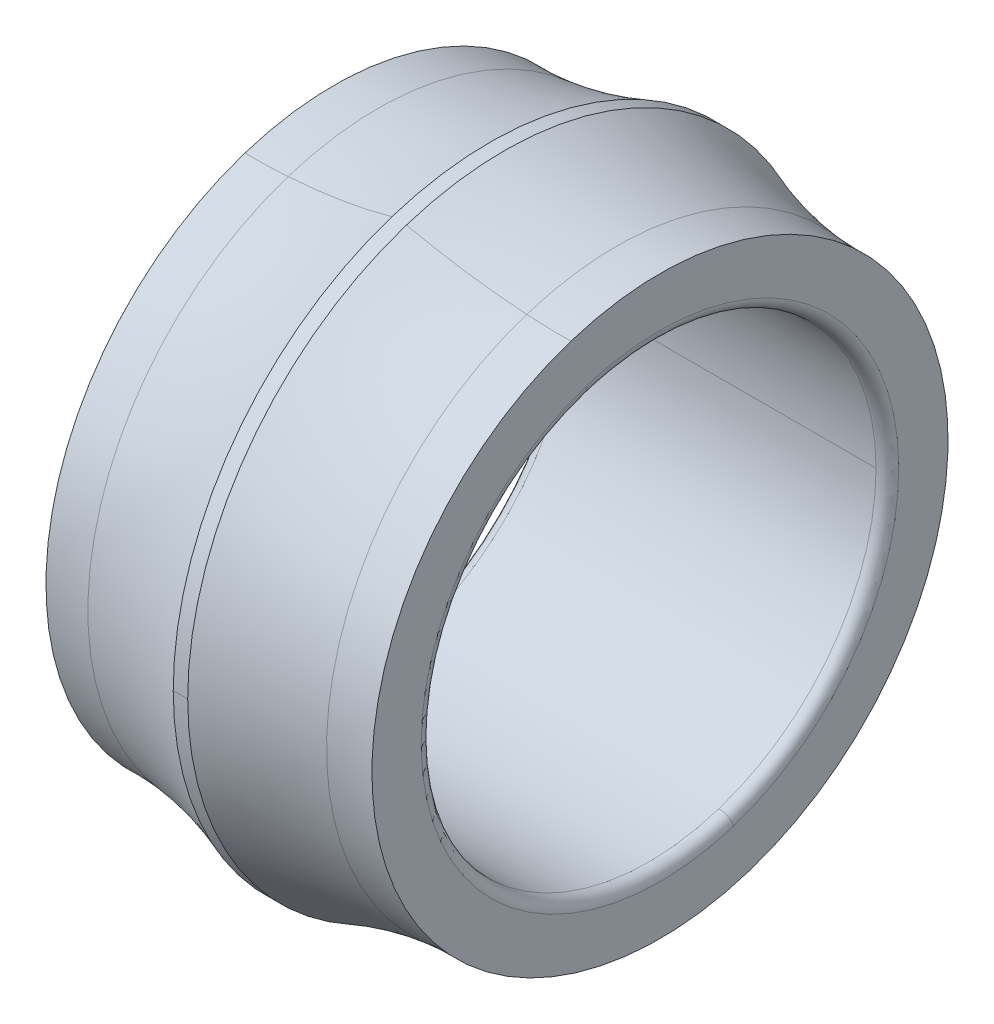
ISO-10303-21;
HEADER;
FILE_DESCRIPTION(('STEP AP214'),'2;1');
FILE_NAME('part.step','',(''),(''),'','','');
FILE_SCHEMA(('AUTOMOTIVE_DESIGN { 1 0 10303 214 1 1 1 1 }'));
ENDSEC;
DATA;
#1=APPLICATION_CONTEXT('core data for automotive mechanical design processes');
#2=APPLICATION_PROTOCOL_DEFINITION('international standard','automotive_design',2000,#1);
#3=PRODUCT_CONTEXT('',#1,'mechanical');
#4=PRODUCT('Part','Part','',(#3));
#5=PRODUCT_RELATED_PRODUCT_CATEGORY('part','',(#4));
#6=PRODUCT_DEFINITION_FORMATION('','',#4);
#7=PRODUCT_DEFINITION_CONTEXT('part definition',#1,'design');
#8=PRODUCT_DEFINITION('design','',#6,#7);
#9=PRODUCT_DEFINITION_SHAPE('','',#8);
#10=(LENGTH_UNIT() NAMED_UNIT(*) SI_UNIT(.MILLI.,.METRE.));
#11=(NAMED_UNIT(*) PLANE_ANGLE_UNIT() SI_UNIT($,.RADIAN.));
#12=(NAMED_UNIT(*) SI_UNIT($,.STERADIAN.) SOLID_ANGLE_UNIT());
#13=UNCERTAINTY_MEASURE_WITH_UNIT(LENGTH_MEASURE(1.E-05),#10,'distance_accuracy_value','');
#14=(GEOMETRIC_REPRESENTATION_CONTEXT(3) GLOBAL_UNCERTAINTY_ASSIGNED_CONTEXT((#13)) GLOBAL_UNIT_ASSIGNED_CONTEXT((#10,
#11,#12)) REPRESENTATION_CONTEXT('',''));
#15=CARTESIAN_POINT('',(0.,0.,0.));
#16=DIRECTION('',(0.,0.,1.));
#17=DIRECTION('',(1.,0.,0.));
#18=AXIS2_PLACEMENT_3D('',#15,#16,#17);
#19=CARTESIAN_POINT('',(0.,76.,0.));
#20=DIRECTION('',(-1.,0.,0.));
#21=DIRECTION('',(0.,0.,1.));
#22=AXIS2_PLACEMENT_3D('',#19,#20,#21);
#23=PLANE('',#22);
#24=CARTESIAN_POINT('',(0.,0.,0.));
#25=DIRECTION('',(1.,0.,0.));
#26=DIRECTION('',(0.,0.,-1.));
#27=AXIS2_PLACEMENT_3D('',#24,#25,#26);
#28=CIRCLE('',#27,63.);
#29=CARTESIAN_POINT('',(0.,59.9165605265947,19.4680706456217));
#30=VERTEX_POINT('',#29);
#31=CARTESIAN_POINT('',(0.,-59.9165605265947,-19.4680706456217));
#32=VERTEX_POINT('',#31);
#33=EDGE_CURVE('E11',#30,#32,#28,.T.);
#34=ORIENTED_EDGE('',*,*,#33,.T.);
#35=CARTESIAN_POINT('',(0.,-59.9165605265947,-19.4680706456217));
#36=CARTESIAN_POINT('',(0.,-56.8583989349152,-28.8796539022212));
#37=CARTESIAN_POINT('',(0.,-51.953038420579,-37.6913393008345));
#38=CARTESIAN_POINT('',(0.,-45.3543236026861,-45.4170253090255));
#39=CARTESIAN_POINT('',(0.,-29.48336715629,-57.8643440421352));
#40=CARTESIAN_POINT('',(0.,-10.0845480190999,-63.3879307021728));
#41=CARTESIAN_POINT('',(0.,0.0443392231772033,-64.1851086887682));
#42=CARTESIAN_POINT('',(0.,20.0683771201649,-61.7641138805563));
#43=CARTESIAN_POINT('',(0.,37.6911891189796,-51.9529056564982));
#44=CARTESIAN_POINT('',(0.,45.4170615681163,-45.3543645746572));
#45=CARTESIAN_POINT('',(0.,57.8643531423797,-29.4833492960546));
#46=CARTESIAN_POINT('',(0.,63.3878762425928,-10.0845427675995));
#47=CARTESIAN_POINT('',(0.,64.1853043718456,0.0442957602732115));
#48=CARTESIAN_POINT('',(0.,62.9744456663331,10.0563975643414));
#49=CARTESIAN_POINT('',(0.,59.9165605265947,19.4680706456217));
#50=B_SPLINE_CURVE_WITH_KNOTS('',5,(#35,#36,#37,#38,#39,#40,#41,#42,#43,#44,#45,#46,#47,#48,
#49),.UNSPECIFIED.,.F.,.F.,(6,3,3,3,6),(0.,0.785398163397448,1.5707963267949,2.35619449019234,
3.14159265358979),.UNSPECIFIED.);
#51=EDGE_CURVE('E26',#32,#30,#50,.T.);
#52=ORIENTED_EDGE('',*,*,#51,.T.);
#53=EDGE_LOOP('',(#34,#52));
#54=FACE_BOUND('',#53,.T.);
#55=CARTESIAN_POINT('',(-1.38777878078145E-13,0.,0.));
#56=DIRECTION('',(1.,0.,0.));
#57=DIRECTION('',(0.,0.,-1.));
#58=AXIS2_PLACEMENT_3D('',#55,#56,#57);
#59=CIRCLE('',#58,76.);
#60=CARTESIAN_POINT('',(0.,72.2802952384316,23.485291572496));
#61=VERTEX_POINT('',#60);
#62=CARTESIAN_POINT('',(0.,-72.2802952384316,-23.485291572496));
#63=VERTEX_POINT('',#62);
#64=EDGE_CURVE('E368',#61,#63,#59,.T.);
#65=ORIENTED_EDGE('',*,*,#64,.F.);
#66=CARTESIAN_POINT('',(-1.38777878078145E-13,0.,0.));
#67=DIRECTION('',(1.,0.,0.));
#68=DIRECTION('',(0.,-0.951056516295154,-0.309016994374947));
#69=AXIS2_PLACEMENT_3D('',#66,#67,#68);
#70=CIRCLE('',#69,76.);
#71=EDGE_CURVE('E363',#63,#61,#70,.T.);
#72=ORIENTED_EDGE('',*,*,#71,.F.);
#73=EDGE_LOOP('',(#65,#72));
#74=FACE_BOUND('',#73,.T.);
#75=ADVANCED_FACE('F17',(#54,#74),#23,.T.);
#76=CARTESIAN_POINT('',(2.37194878616791,0.,0.));
#77=DIRECTION('',(1.,0.,0.));
#78=DIRECTION('',(0.,-0.309016994374947,0.951056516295154));
#79=AXIS2_PLACEMENT_3D('',#76,#77,#78);
#80=TOROIDAL_SURFACE('',#79,161.967283654771,86.0000000001395);
#81=CARTESIAN_POINT('',(2.37194878616791,-154.040040546495,-50.0506431820717));
#82=DIRECTION('',(0.,0.309016994374947,-0.951056516295154));
#83=DIRECTION('',(-0.0275807998391167,0.950694712882917,0.308899437320147));
#84=AXIS2_PLACEMENT_3D('',#81,#82,#83);
#85=CIRCLE('',#84,86.0000000001395);
#86=CARTESIAN_POINT('',(11.5183087513062,-72.7130624133017,-23.6259061514943));
#87=VERTEX_POINT('',#86);
#88=EDGE_CURVE('E358',#63,#87,#85,.T.);
#89=ORIENTED_EDGE('',*,*,#88,.F.);
#90=ORIENTED_EDGE('',*,*,#71,.T.);
#91=CARTESIAN_POINT('',(2.37194878616791,154.040040546495,50.0506431820717));
#92=DIRECTION('',(0.,-0.309016994374947,0.951056516295154));
#93=DIRECTION('',(-0.0275807998391176,-0.950694712882916,-0.308899437320147));
#94=AXIS2_PLACEMENT_3D('',#91,#92,#93);
#95=CIRCLE('',#94,86.0000000001395);
#96=CARTESIAN_POINT('',(11.5183087513061,72.7130624133017,23.6259061514943));
#97=VERTEX_POINT('',#96);
#98=EDGE_CURVE('E354',#61,#97,#95,.T.);
#99=ORIENTED_EDGE('',*,*,#98,.T.);
#100=CARTESIAN_POINT('',(11.518308751306,0.,0.));
#101=DIRECTION('',(1.,0.,0.));
#102=DIRECTION('',(0.,-0.951056516295154,-0.309016994374947));
#103=AXIS2_PLACEMENT_3D('',#100,#101,#102);
#104=CIRCLE('',#103,76.455038336266);
#105=EDGE_CURVE('E349',#87,#97,#104,.T.);
#106=ORIENTED_EDGE('',*,*,#105,.F.);
#107=EDGE_LOOP('',(#89,#90,#99,#106));
#108=FACE_BOUND('',#107,.T.);
#109=ADVANCED_FACE('F389',(#108),#80,.F.);
#110=CARTESIAN_POINT('',(0.196432480434876,0.,0.));
#111=DIRECTION('',(1.,0.,0.));
#112=DIRECTION('',(0.,-0.309016994374947,0.951056516295154));
#113=AXIS2_PLACEMENT_3D('',#110,#111,#112);
#114=TOROIDAL_SURFACE('',#113,189.428633383765,113.539499999996);
#115=CARTESIAN_POINT('',(0.196432480434876,-180.157336152515,-58.5366669368048));
#116=DIRECTION('',(0.,0.309016994374947,-0.951056516295154));
#117=DIRECTION('',(0.0997175103895268,0.946316248875652,0.30747678812494));
#118=AXIS2_PLACEMENT_3D('',#115,#116,#117);
#119=CIRCLE('',#118,113.539499999996);
#120=CARTESIAN_POINT('',(41.0917087807872,-79.4225611437111,-25.805954440854));
#121=VERTEX_POINT('',#120);
#122=EDGE_CURVE('E344',#87,#121,#119,.T.);
#123=ORIENTED_EDGE('',*,*,#122,.F.);
#124=ORIENTED_EDGE('',*,*,#105,.T.);
#125=CARTESIAN_POINT('',(0.196432480434876,180.157336152515,58.5366669368049));
#126=DIRECTION('',(0.,-0.309016994374947,0.951056516295154));
#127=DIRECTION('',(0.0997175103895259,-0.946316248875652,-0.30747678812494));
#128=AXIS2_PLACEMENT_3D('',#125,#126,#127);
#129=CIRCLE('',#128,113.539499999996);
#130=CARTESIAN_POINT('',(41.0917087807871,79.422561143711,25.805954440854));
#131=VERTEX_POINT('',#130);
#132=EDGE_CURVE('E340',#97,#131,#129,.T.);
#133=ORIENTED_EDGE('',*,*,#132,.T.);
#134=CARTESIAN_POINT('',(41.091708780787,0.,0.));
#135=DIRECTION('',(1.,0.,0.));
#136=DIRECTION('',(0.,0.,-1.));
#137=AXIS2_PLACEMENT_3D('',#134,#135,#136);
#138=CIRCLE('',#137,83.509822794866);
#139=CARTESIAN_POINT('',(41.091708780787,0.,-83.509822794866));
#140=VERTEX_POINT('',#139);
#141=EDGE_CURVE('E335',#140,#131,#138,.T.);
#142=ORIENTED_EDGE('',*,*,#141,.F.);
#143=CARTESIAN_POINT('',(41.091708780787,0.,0.));
#144=DIRECTION('',(1.,0.,0.));
#145=DIRECTION('',(0.,0.,-1.));
#146=AXIS2_PLACEMENT_3D('',#143,#144,#145);
#147=CIRCLE('',#146,83.509822794866);
#148=EDGE_CURVE('E330',#121,#140,#147,.T.);
#149=ORIENTED_EDGE('',*,*,#148,.F.);
#150=EDGE_LOOP('',(#123,#124,#133,#142,#149));
#151=FACE_BOUND('',#150,.T.);
#152=ADVANCED_FACE('F392',(#151),#114,.F.);
#153=CARTESIAN_POINT('',(86.,0.,0.));
#154=DIRECTION('',(1.,0.,0.));
#155=DIRECTION('',(0.,1.,0.));
#156=AXIS2_PLACEMENT_3D('',#153,#154,#155);
#157=CYLINDRICAL_SURFACE('',#156,83.509822794866);
#158=DIRECTION('',(1.,0.,0.));
#159=VECTOR('',#158,1.);
#160=CARTESIAN_POINT('',(41.091708780787,0.,83.509822794866));
#161=LINE('',#160,#159);
#162=CARTESIAN_POINT('',(41.091708780787,0.,83.509822794866));
#163=VERTEX_POINT('',#162);
#164=CARTESIAN_POINT('',(44.908291219213,0.,83.509822794866));
#165=VERTEX_POINT('',#164);
#166=EDGE_CURVE('E325',#163,#165,#161,.T.);
#167=ORIENTED_EDGE('',*,*,#166,.F.);
#168=CARTESIAN_POINT('',(41.091708780787,0.,0.));
#169=DIRECTION('',(1.,0.,0.));
#170=DIRECTION('',(0.,0.,-1.));
#171=AXIS2_PLACEMENT_3D('',#168,#169,#170);
#172=CIRCLE('',#171,83.509822794866);
#173=EDGE_CURVE('E320',#163,#121,#172,.T.);
#174=ORIENTED_EDGE('',*,*,#173,.T.);
#175=ORIENTED_EDGE('',*,*,#148,.T.);
#176=DIRECTION('',(1.,0.,0.));
#177=VECTOR('',#176,1.);
#178=CARTESIAN_POINT('',(41.091708780787,0.,-83.509822794866));
#179=LINE('',#178,#177);
#180=CARTESIAN_POINT('',(44.908291219213,0.,-83.509822794866));
#181=VERTEX_POINT('',#180);
#182=EDGE_CURVE('E316',#140,#181,#179,.T.);
#183=ORIENTED_EDGE('',*,*,#182,.T.);
#184=CARTESIAN_POINT('',(44.908291219213,0.,0.));
#185=DIRECTION('',(1.,0.,0.));
#186=DIRECTION('',(0.,0.,-1.));
#187=AXIS2_PLACEMENT_3D('',#184,#185,#186);
#188=CIRCLE('',#187,83.509822794866);
#189=CARTESIAN_POINT('',(44.9082912192132,-79.4225611437111,-25.8059544408531));
#190=VERTEX_POINT('',#189);
#191=EDGE_CURVE('E311',#190,#181,#188,.T.);
#192=ORIENTED_EDGE('',*,*,#191,.F.);
#193=CARTESIAN_POINT('',(44.908291219213,0.,0.));
#194=DIRECTION('',(1.,0.,0.));
#195=DIRECTION('',(0.,0.,-1.));
#196=AXIS2_PLACEMENT_3D('',#193,#194,#195);
#197=CIRCLE('',#196,83.509822794866);
#198=EDGE_CURVE('E306',#165,#190,#197,.T.);
#199=ORIENTED_EDGE('',*,*,#198,.F.);
#200=EDGE_LOOP('',(#167,#174,#175,#183,#192,#199));
#201=FACE_BOUND('',#200,.T.);
#202=ADVANCED_FACE('F403',(#201),#157,.T.);
#203=CARTESIAN_POINT('',(85.8035675195625,0.,0.));
#204=DIRECTION('',(1.,0.,0.));
#205=DIRECTION('',(0.,0.309016994374937,-0.951056516295157));
#206=AXIS2_PLACEMENT_3D('',#203,#204,#205);
#207=TOROIDAL_SURFACE('',#206,189.42863338375,113.539499999982);
#208=CARTESIAN_POINT('',(85.8035675195625,-180.157336152502,-58.5366669367984));
#209=DIRECTION('',(0.,0.309016994374937,-0.951056516295157));
#210=DIRECTION('',(-0.360185453523715,0.887222288356097,0.288275996423716));
#211=AXIS2_PLACEMENT_3D('',#208,#209,#210);
#212=CIRCLE('',#211,113.539499999982);
#213=CARTESIAN_POINT('',(74.4816912487021,-72.7130624133006,-23.625906151494));
#214=VERTEX_POINT('',#213);
#215=EDGE_CURVE('E302',#190,#214,#212,.T.);
#216=ORIENTED_EDGE('',*,*,#215,.T.);
#217=CARTESIAN_POINT('',(74.481691248702,0.,0.));
#218=DIRECTION('',(1.,0.,0.));
#219=DIRECTION('',(0.,0.,-1.));
#220=AXIS2_PLACEMENT_3D('',#217,#218,#219);
#221=CIRCLE('',#220,76.455038336265);
#222=CARTESIAN_POINT('',(74.4816912487021,72.7130624133006,23.625906151494));
#223=VERTEX_POINT('',#222);
#224=EDGE_CURVE('E297',#223,#214,#221,.T.);
#225=ORIENTED_EDGE('',*,*,#224,.F.);
#226=CARTESIAN_POINT('',(85.8035675195625,180.157336152502,58.5366669368004));
#227=DIRECTION('',(0.,-0.309016994374947,0.951056516295154));
#228=DIRECTION('',(-0.360185453523715,-0.887222288356094,-0.288275996423726));
#229=AXIS2_PLACEMENT_3D('',#226,#227,#228);
#230=CIRCLE('',#229,113.539499999982);
#231=CARTESIAN_POINT('',(44.9082912192131,79.4225611437108,25.8059544408539));
#232=VERTEX_POINT('',#231);
#233=EDGE_CURVE('E292',#232,#223,#230,.T.);
#234=ORIENTED_EDGE('',*,*,#233,.F.);
#235=CARTESIAN_POINT('',(44.908291219213,0.,0.));
#236=DIRECTION('',(1.,0.,0.));
#237=DIRECTION('',(0.,0.,-1.));
#238=AXIS2_PLACEMENT_3D('',#235,#236,#237);
#239=CIRCLE('',#238,83.509822794866);
#240=EDGE_CURVE('E287',#232,#165,#239,.T.);
#241=ORIENTED_EDGE('',*,*,#240,.T.);
#242=ORIENTED_EDGE('',*,*,#198,.T.);
#243=EDGE_LOOP('',(#216,#225,#234,#241,#242));
#244=FACE_BOUND('',#243,.T.);
#245=ADVANCED_FACE('F406',(#244),#207,.F.);
#246=CARTESIAN_POINT('',(86.,0.,0.));
#247=DIRECTION('',(1.,0.,0.));
#248=DIRECTION('',(0.,-1.,0.));
#249=AXIS2_PLACEMENT_3D('',#246,#247,#248);
#250=CYLINDRICAL_SURFACE('',#249,83.509822794866);
#251=ORIENTED_EDGE('',*,*,#166,.T.);
#252=ORIENTED_EDGE('',*,*,#240,.F.);
#253=CARTESIAN_POINT('',(44.908291219213,0.,0.));
#254=DIRECTION('',(1.,0.,0.));
#255=DIRECTION('',(0.,0.,-1.));
#256=AXIS2_PLACEMENT_3D('',#253,#254,#255);
#257=CIRCLE('',#256,83.509822794866);
#258=EDGE_CURVE('E282',#181,#232,#257,.T.);
#259=ORIENTED_EDGE('',*,*,#258,.F.);
#260=ORIENTED_EDGE('',*,*,#182,.F.);
#261=ORIENTED_EDGE('',*,*,#141,.T.);
#262=CARTESIAN_POINT('',(41.091708780787,0.,0.));
#263=DIRECTION('',(1.,0.,0.));
#264=DIRECTION('',(0.,0.,-1.));
#265=AXIS2_PLACEMENT_3D('',#262,#263,#264);
#266=CIRCLE('',#265,83.509822794866);
#267=EDGE_CURVE('E277',#131,#163,#266,.T.);
#268=ORIENTED_EDGE('',*,*,#267,.T.);
#269=EDGE_LOOP('',(#251,#252,#259,#260,#261,#268));
#270=FACE_BOUND('',#269,.T.);
#271=ADVANCED_FACE('F400',(#270),#250,.T.);
#272=CARTESIAN_POINT('',(0.196432480434876,0.,0.));
#273=DIRECTION('',(1.,0.,0.));
#274=DIRECTION('',(0.,0.309016994374947,-0.951056516295154));
#275=AXIS2_PLACEMENT_3D('',#272,#273,#274);
#276=TOROIDAL_SURFACE('',#275,189.428633383765,113.539499999996);
#277=ORIENTED_EDGE('',*,*,#122,.T.);
#278=ORIENTED_EDGE('',*,*,#173,.F.);
#279=ORIENTED_EDGE('',*,*,#267,.F.);
#280=ORIENTED_EDGE('',*,*,#132,.F.);
#281=CARTESIAN_POINT('',(11.518308751306,0.,0.));
#282=DIRECTION('',(1.,0.,0.));
#283=DIRECTION('',(0.,0.,-1.));
#284=AXIS2_PLACEMENT_3D('',#281,#282,#283);
#285=CIRCLE('',#284,76.455038336266);
#286=EDGE_CURVE('E272',#97,#87,#285,.T.);
#287=ORIENTED_EDGE('',*,*,#286,.T.);
#288=EDGE_LOOP('',(#277,#278,#279,#280,#287));
#289=FACE_BOUND('',#288,.T.);
#290=ADVANCED_FACE('F397',(#289),#276,.F.);
#291=CARTESIAN_POINT('',(2.37194878616791,0.,0.));
#292=DIRECTION('',(1.,0.,0.));
#293=DIRECTION('',(0.,0.309016994374947,-0.951056516295154));
#294=AXIS2_PLACEMENT_3D('',#291,#292,#293);
#295=TOROIDAL_SURFACE('',#294,161.967283654771,86.0000000001395);
#296=ORIENTED_EDGE('',*,*,#88,.T.);
#297=ORIENTED_EDGE('',*,*,#286,.F.);
#298=ORIENTED_EDGE('',*,*,#98,.F.);
#299=ORIENTED_EDGE('',*,*,#64,.T.);
#300=EDGE_LOOP('',(#296,#297,#298,#299));
#301=FACE_BOUND('',#300,.T.);
#302=ADVANCED_FACE('F385',(#301),#295,.F.);
#303=CARTESIAN_POINT('',(85.8035675195625,0.,0.));
#304=DIRECTION('',(1.,0.,0.));
#305=DIRECTION('',(0.,-0.309016994374942,0.951056516295155));
#306=AXIS2_PLACEMENT_3D('',#303,#304,#305);
#307=TOROIDAL_SURFACE('',#306,189.42863338375,113.539499999982);
#308=ORIENTED_EDGE('',*,*,#215,.F.);
#309=ORIENTED_EDGE('',*,*,#191,.T.);
#310=ORIENTED_EDGE('',*,*,#258,.T.);
#311=ORIENTED_EDGE('',*,*,#233,.T.);
#312=CARTESIAN_POINT('',(74.481691248702,0.,0.));
#313=DIRECTION('',(1.,0.,0.));
#314=DIRECTION('',(0.,-0.951056516295154,-0.309016994374947));
#315=AXIS2_PLACEMENT_3D('',#312,#313,#314);
#316=CIRCLE('',#315,76.455038336265);
#317=EDGE_CURVE('E267',#214,#223,#316,.T.);
#318=ORIENTED_EDGE('',*,*,#317,.F.);
#319=EDGE_LOOP('',(#308,#309,#310,#311,#318));
#320=FACE_BOUND('',#319,.T.);
#321=ADVANCED_FACE('F410',(#320),#307,.F.);
#322=CARTESIAN_POINT('',(83.6280512138326,0.,0.));
#323=DIRECTION('',(1.,0.,0.));
#324=DIRECTION('',(0.,-0.309016994374947,0.951056516295154));
#325=AXIS2_PLACEMENT_3D('',#322,#323,#324);
#326=TOROIDAL_SURFACE('',#325,161.967283654811,86.0000000001799);
#327=CARTESIAN_POINT('',(83.6280512138326,-154.040040546534,-50.0506431820842));
#328=DIRECTION('',(0.,0.309016994374947,-0.951056516295154));
#329=DIRECTION('',(-0.106353022850132,0.945662536430963,0.307264384075988));
#330=AXIS2_PLACEMENT_3D('',#327,#328,#329);
#331=CIRCLE('',#330,86.0000000001799);
#332=CARTESIAN_POINT('',(86.0000000000001,-72.2802952384316,-23.485291572496));
#333=VERTEX_POINT('',#332);
#334=EDGE_CURVE('E262',#214,#333,#331,.T.);
#335=ORIENTED_EDGE('',*,*,#334,.F.);
#336=ORIENTED_EDGE('',*,*,#317,.T.);
#337=CARTESIAN_POINT('',(83.6280512138326,154.040040546534,50.0506431820842));
#338=DIRECTION('',(0.,-0.309016994374947,0.951056516295154));
#339=DIRECTION('',(-0.106353022850133,-0.945662536430963,-0.307264384075988));
#340=AXIS2_PLACEMENT_3D('',#337,#338,#339);
#341=CIRCLE('',#340,86.0000000001799);
#342=CARTESIAN_POINT('',(86.0000000000001,72.2802952384316,23.485291572496));
#343=VERTEX_POINT('',#342);
#344=EDGE_CURVE('E258',#223,#343,#341,.T.);
#345=ORIENTED_EDGE('',*,*,#344,.T.);
#346=CARTESIAN_POINT('',(86.,0.,0.));
#347=DIRECTION('',(1.,0.,0.));
#348=DIRECTION('',(0.,-0.951056516295154,-0.309016994374947));
#349=AXIS2_PLACEMENT_3D('',#346,#347,#348);
#350=CIRCLE('',#349,76.);
#351=EDGE_CURVE('E253',#333,#343,#350,.T.);
#352=ORIENTED_EDGE('',*,*,#351,.F.);
#353=EDGE_LOOP('',(#335,#336,#345,#352));
#354=FACE_BOUND('',#353,.T.);
#355=ADVANCED_FACE('F414',(#354),#326,.F.);
#356=CARTESIAN_POINT('',(86.,63.,0.));
#357=DIRECTION('',(1.,0.,0.));
#358=DIRECTION('',(0.,0.,-1.));
#359=AXIS2_PLACEMENT_3D('',#356,#357,#358);
#360=PLANE('',#359);
#361=CARTESIAN_POINT('',(86.,0.,0.));
#362=DIRECTION('',(1.,0.,0.));
#363=DIRECTION('',(0.,0.,-1.));
#364=AXIS2_PLACEMENT_3D('',#361,#362,#363);
#365=CIRCLE('',#364,76.);
#366=EDGE_CURVE('E250',#343,#333,#365,.T.);
#367=ORIENTED_EDGE('',*,*,#366,.T.);
#368=ORIENTED_EDGE('',*,*,#351,.T.);
#369=EDGE_LOOP('',(#367,#368));
#370=FACE_BOUND('',#369,.T.);
#371=CARTESIAN_POINT('',(86.,-59.9165605265935,-19.4680706456214));
#372=CARTESIAN_POINT('',(86.,-59.5980354402386,-20.4484608218539));
#373=CARTESIAN_POINT('',(86.,-59.2554078714925,-21.4210176704443));
#374=CARTESIAN_POINT('',(86.,-58.52286303887,-23.3481558908875));
#375=CARTESIAN_POINT('',(86.,-58.1329457749937,-24.3027372627402));
#376=CARTESIAN_POINT('',(86.,-57.3067368217631,-26.1916157082547));
#377=CARTESIAN_POINT('',(86.,-56.870445132409,-27.1259127819164));
#378=CARTESIAN_POINT('',(86.,-55.9525448440446,-28.9719742796516));
#379=CARTESIAN_POINT('',(86.,-55.4709362450343,-29.8837387037251));
#380=CARTESIAN_POINT('',(86.,-54.4635606461359,-31.6825377248902));
#381=CARTESIAN_POINT('',(86.,-53.9377936462477,-32.5695723219817));
#382=CARTESIAN_POINT('',(86.,-52.8433683275037,-34.3167749211953));
#383=CARTESIAN_POINT('',(86.,-52.2747100086478,-35.1769429233175));
#384=CARTESIAN_POINT('',(86.,-51.0958718755649,-36.8683400653604));
#385=CARTESIAN_POINT('',(86.,-50.4856920613378,-37.6995692052812));
#386=CARTESIAN_POINT('',(86.,-49.2252809473834,-39.3310861317563));
#387=CARTESIAN_POINT('',(86.,-48.5750496476561,-40.1313739183106));
#388=CARTESIAN_POINT('',(86.,-47.2361020179458,-41.6990801712911));
#389=CARTESIAN_POINT('',(86.,-46.5473856879628,-42.4664986377173));
#390=CARTESIAN_POINT('',(86.,-45.1331271780918,-43.9666174730455));
#391=CARTESIAN_POINT('',(86.,-44.4075849982038,-44.6993178419475));
#392=CARTESIAN_POINT('',(86.,-42.9214226825446,-46.1282353426186));
#393=CARTESIAN_POINT('',(86.,-42.1608025467733,-46.8244524743877));
#394=CARTESIAN_POINT('',(86.,-40.6063167200483,-48.1787262528061));
#395=CARTESIAN_POINT('',(86.,-39.8124510290946,-48.8367828994555));
#396=CARTESIAN_POINT('',(86.,-38.1933865839429,-50.1131503915165));
#397=CARTESIAN_POINT('',(86.,-37.3681878297448,-50.731461236928));
#398=CARTESIAN_POINT('',(86.,-35.6884452341944,-51.9268475615337));
#399=CARTESIAN_POINT('',(86.,-34.833901392842,-52.5039230407279));
#400=CARTESIAN_POINT('',(86.,-33.0975272939426,-53.6154484075223));
#401=CARTESIAN_POINT('',(86.,-32.2156970363957,-54.1498982951225));
#402=CARTESIAN_POINT('',(86.,-30.4268745114376,-55.174884942138));
#403=CARTESIAN_POINT('',(86.,-29.5198822440265,-55.6654217015532));
#404=CARTESIAN_POINT('',(86.,-27.6829207231553,-56.6014003461791));
#405=CARTESIAN_POINT('',(86.,-26.7529514696952,-57.0468422313897));
#406=CARTESIAN_POINT('',(86.,-24.8722763541134,-57.891558019089));
#407=CARTESIAN_POINT('',(86.,-23.9215704919916,-58.2908319215776));
#408=CARTESIAN_POINT('',(86.,-22.0017124927803,-59.0422498580294));
#409=CARTESIAN_POINT('',(86.,-21.0325603556907,-59.3943938919926));
#410=CARTESIAN_POINT('',(86.,-19.0781445789297,-60.0507037455715));
#411=CARTESIAN_POINT('',(86.,-18.0928809392583,-60.3548695651872));
#412=CARTESIAN_POINT('',(86.,-16.1086157437404,-60.91449022797));
#413=CARTESIAN_POINT('',(86.,-15.109614187894,-61.1699450711371));
#414=CARTESIAN_POINT('',(86.,-13.1002798422763,-61.6315283679302));
#415=CARTESIAN_POINT('',(86.,-12.0899470525051,-61.8376568215562));
#416=CARTESIAN_POINT('',(86.,-10.0603842192232,-62.2000907577677));
#417=CARTESIAN_POINT('',(86.,-9.04115417571247,-62.3563962403532));
#418=CARTESIAN_POINT('',(86.,-6.99625224940035,-62.6188076808853));
#419=CARTESIAN_POINT('',(86.,-5.97058036659894,-62.7249136388319));
#420=CARTESIAN_POINT('',(86.,-3.91526569510937,-62.8866704115398));
#421=CARTESIAN_POINT('',(86.,-2.88562290642119,-62.9423212263011));
#422=CARTESIAN_POINT('',(86.,-0.824846922822108,-63.0030336449512));
#423=CARTESIAN_POINT('',(86.,0.206286272088803,-63.0080952488399));
#424=CARTESIAN_POINT('',(86.,2.26755897795026,-62.9676170518978));
#425=CARTESIAN_POINT('',(86.,3.29769848890081,-62.922077251067));
#426=CARTESIAN_POINT('',(86.,5.35450213053006,-62.7805059540546));
#427=CARTESIAN_POINT('',(86.,6.38116626120877,-62.6844744578731));
#428=CARTESIAN_POINT('',(86.,8.42854581847839,-62.4421511184452));
#429=CARTESIAN_POINT('',(86.,9.44926124506931,-62.2958592751988));
#430=CARTESIAN_POINT('',(86.,11.4822844012966,-61.953367671505));
#431=CARTESIAN_POINT('',(86.,12.494592130933,-61.7571679110576));
#432=CARTESIAN_POINT('',(86.,14.5083611552628,-61.31533313537));
#433=CARTESIAN_POINT('',(86.,15.5098224499562,-61.0696981201297));
#434=CARTESIAN_POINT('',(86.,17.4994859964236,-60.529584591123));
#435=CARTESIAN_POINT('',(86.,18.4876882481975,-60.2351060773566));
#436=CARTESIAN_POINT('',(86.,20.448453043045,-59.5980149758305));
#437=CARTESIAN_POINT('',(86.,21.4210155861186,-59.2554023880709));
#438=CARTESIAN_POINT('',(86.,23.3481579752128,-58.5228685222917));
#439=CARTESIAN_POINT('',(86.,24.3027378212334,-58.1329472442721));
#440=CARTESIAN_POINT('',(86.,26.1916151497612,-57.3067353524848));
#441=CARTESIAN_POINT('',(86.,27.1259126322685,-56.8704447387171));
#442=CARTESIAN_POINT('',(86.,28.9719744292993,-55.9525452377366));
#443=CARTESIAN_POINT('',(86.,29.883738743823,-55.4709363505239));
#444=CARTESIAN_POINT('',(86.,31.682537684792,-54.4635605406466));
#445=CARTESIAN_POINT('',(86.,32.5695723112373,-53.937793617982));
#446=CARTESIAN_POINT('',(86.,34.3167749319394,-52.8433683557696));
#447=CARTESIAN_POINT('',(86.,35.1769429261963,-52.2747100162217));
#448=CARTESIAN_POINT('',(86.,36.8683400624814,-51.0958718679911));
#449=CARTESIAN_POINT('',(86.,37.6995692045097,-50.4856920593085));
#450=CARTESIAN_POINT('',(86.,39.3310861325276,-49.2252809494129));
#451=CARTESIAN_POINT('',(86.,40.1313739185172,-48.5750496482));
#452=CARTESIAN_POINT('',(86.,41.6990801710842,-47.2361020174022));
#453=CARTESIAN_POINT('',(86.,42.4664986376617,-46.5473856878172));
#454=CARTESIAN_POINT('',(86.,43.9666174731007,-45.1331271782376));
#455=CARTESIAN_POINT('',(86.,44.6993178419622,-44.407584998243));
#456=CARTESIAN_POINT('',(86.,46.1282353426036,-42.9214226825056));
#457=CARTESIAN_POINT('',(86.,46.8244524743836,-42.1608025467629));
#458=CARTESIAN_POINT('',(86.,48.17872625281,-40.6063167200589));
#459=CARTESIAN_POINT('',(86.,48.8367828994565,-39.8124510290976));
#460=CARTESIAN_POINT('',(86.,50.1131503915153,-38.1933865839402));
#461=CARTESIAN_POINT('',(86.,50.7314612369276,-37.3681878297443));
#462=CARTESIAN_POINT('',(86.,51.9268475615339,-35.6884452341953));
#463=CARTESIAN_POINT('',(86.,52.5039230407278,-34.8339013928424));
#464=CARTESIAN_POINT('',(86.,53.6154484075221,-33.0975272939426));
#465=CARTESIAN_POINT('',(86.,54.1498982951224,-32.2156970363958));
#466=CARTESIAN_POINT('',(86.,55.1748849421379,-30.4268745114378));
#467=CARTESIAN_POINT('',(86.,55.6654217015531,-29.5198822440267));
#468=CARTESIAN_POINT('',(86.,56.601400346179,-27.6829207231554));
#469=CARTESIAN_POINT('',(86.,57.0468422313896,-26.7529514696954));
#470=CARTESIAN_POINT('',(86.,57.891558019089,-24.8722763541135));
#471=CARTESIAN_POINT('',(86.,58.2908319215778,-23.9215704919917));
#472=CARTESIAN_POINT('',(86.,59.0422498580291,-22.0017124927805));
#473=CARTESIAN_POINT('',(86.,59.3943938919917,-21.0325603556911));
#474=CARTESIAN_POINT('',(86.,60.0507037455722,-19.0781445789297));
#475=CARTESIAN_POINT('',(86.,60.3548695651901,-18.0928809392577));
#476=CARTESIAN_POINT('',(86.,60.9144902279671,-16.1086157437414));
#477=CARTESIAN_POINT('',(86.,61.1699450711263,-15.1096141878971));
#478=CARTESIAN_POINT('',(86.,61.631528367941,-13.1002798422736));
#479=CARTESIAN_POINT('',(86.,61.8376568215965,-12.0899470524943));
#480=CARTESIAN_POINT('',(86.,62.2000907577274,-10.0603842192343));
#481=CARTESIAN_POINT('',(86.,62.3563962402027,-9.04115417575347));
#482=CARTESIAN_POINT('',(86.,62.6188076810357,-6.99625224935969));
#483=CARTESIAN_POINT('',(86.,62.7249136393933,-5.97058036644673));
#484=CARTESIAN_POINT('',(86.,62.8866704109784,-3.91526569526197));
#485=CARTESIAN_POINT('',(86.,62.9423212242059,-2.88562290699018));
#486=CARTESIAN_POINT('',(86.,63.0030336470464,-0.824846922253557));
#487=CARTESIAN_POINT('',(86.,63.0080952566594,0.206286274211275));
#488=CARTESIAN_POINT('',(86.,62.9676170440783,2.26755897582737));
#489=CARTESIAN_POINT('',(86.,62.9220772218841,3.29769848097863));
#490=CARTESIAN_POINT('',(86.,62.7805059832374,5.35450213845182));
#491=CARTESIAN_POINT('',(86.,62.6844745667849,6.38116629077375));
#492=CARTESIAN_POINT('',(86.,62.4421510095335,8.42854578891309));
#493=CARTESIAN_POINT('',(86.,62.2958588687345,9.44926113473049));
#494=CARTESIAN_POINT('',(86.,61.9533680779693,11.4822845116351));
#495=CARTESIAN_POINT('',(86.,61.757169428003,12.4945925427224));
#496=CARTESIAN_POINT('',(86.,61.3153316184247,14.508360743473));
#497=CARTESIAN_POINT('',(86.,61.0696924588126,15.5098209131364));
#498=CARTESIAN_POINT('',(86.,60.5295902524401,17.499487533243));
#499=CARTESIAN_POINT('',(86.,60.2351272056796,18.4876939836862));
#500=CARTESIAN_POINT('',(86.,59.9165605265936,19.4680706456211));
#501=B_SPLINE_CURVE_WITH_KNOTS('',3,(#371,#372,#373,#374,#375,#376,#377,#378,#379,#380,#381,
#382,#383,#384,#385,#386,#387,#388,#389,#390,#391,#392,#393,#394,#395,#396,#397,#398,#399,#400,
#401,#402,#403,#404,#405,#406,#407,#408,#409,#410,#411,#412,#413,#414,#415,#416,#417,#418,#419,
#420,#421,#422,#423,#424,#425,#426,#427,#428,#429,#430,#431,#432,#433,#434,#435,#436,#437,#438,
#439,#440,#441,#442,#443,#444,#445,#446,#447,#448,#449,#450,#451,#452,#453,#454,#455,#456,#457,
#458,#459,#460,#461,#462,#463,#464,#465,#466,#467,#468,#469,#470,#471,#472,#473,#474,#475,#476,
#477,#478,#479,#480,#481,#482,#483,#484,#485,#486,#487,#488,#489,#490,#491,#492,#493,#494,#495,
#496,#497,#498,#499,#500),.UNSPECIFIED.,.F.,.F.,(4,2,2,2,2,2,2,2,2,2,2,2,2,2,2,2,2,2,2,2,2,2,2,
2,2,2,2,2,2,2,2,2,2,2,2,2,2,2,2,2,2,2,2,2,2,2,2,2,2,2,2,2,2,2,2,2,2,2,2,2,2,2,2,2,4),(0.,
3.09219479388687,6.18438958777377,9.27658438166065,12.3687791755475,15.4609739694344,
18.5531687633213,21.6453635572082,24.7375583510951,27.8297531449819,30.9219479388688,
34.0141427327557,37.1063375266426,40.1985323205295,43.2907271144164,46.3829219083032,
49.4751167021901,52.567311496077,55.6595062899639,58.7517010838508,61.8438958777377,
64.9360906716246,68.0282854655114,71.1204802593983,74.2126750532852,77.3048698471721,
80.397064641059,83.4892594349459,86.5814542288327,89.6736490227196,92.7658438166065,
95.8580386104934,98.9502334043803,102.042428198267,105.134622992154,108.226817786041,
111.319012579928,114.411207373815,117.503402167702,120.595596961588,123.687791755475,
126.779986549362,129.872181343249,132.964376137136,136.056570931023,139.14876572491,
142.240960518797,145.333155312683,148.42535010657,151.517544900457,154.609739694344,
157.701934488231,160.794129282118,163.886324076005,166.978518869892,170.070713663779,
173.162908457665,176.255103251552,179.347298045439,182.439492839326,185.531687633213,
188.6238824271,191.716077220987,194.808272014874,197.90046680876),.UNSPECIFIED.);
#502=CARTESIAN_POINT('',(86.,-59.9165605265935,-19.4680706456213));
#503=VERTEX_POINT('',#502);
#504=CARTESIAN_POINT('',(86.,59.9165605265935,19.4680706456213));
#505=VERTEX_POINT('',#504);
#506=EDGE_CURVE('E249',#503,#505,#501,.T.);
#507=ORIENTED_EDGE('',*,*,#506,.F.);
#508=CARTESIAN_POINT('',(86.,59.9165605265935,19.4680706456214));
#509=CARTESIAN_POINT('',(86.,59.5980354402386,20.4484608218539));
#510=CARTESIAN_POINT('',(86.,59.2554078714925,21.4210176704443));
#511=CARTESIAN_POINT('',(86.,58.52286303887,23.3481558908875));
#512=CARTESIAN_POINT('',(86.,58.1329457749937,24.3027372627402));
#513=CARTESIAN_POINT('',(86.,57.3067368217631,26.1916157082547));
#514=CARTESIAN_POINT('',(86.,56.870445132409,27.1259127819164));
#515=CARTESIAN_POINT('',(86.,55.9525448440446,28.9719742796516));
#516=CARTESIAN_POINT('',(86.,55.4709362450343,29.8837387037251));
#517=CARTESIAN_POINT('',(86.,54.4635606461359,31.6825377248902));
#518=CARTESIAN_POINT('',(86.,53.9377936462477,32.5695723219817));
#519=CARTESIAN_POINT('',(86.,52.8433683275037,34.3167749211954));
#520=CARTESIAN_POINT('',(86.,52.2747100086478,35.1769429233175));
#521=CARTESIAN_POINT('',(86.,51.0958718755648,36.8683400653604));
#522=CARTESIAN_POINT('',(86.,50.4856920613378,37.6995692052812));
#523=CARTESIAN_POINT('',(86.,49.2252809473834,39.3310861317563));
#524=CARTESIAN_POINT('',(86.,48.5750496476561,40.1313739183106));
#525=CARTESIAN_POINT('',(86.,47.2361020179458,41.6990801712911));
#526=CARTESIAN_POINT('',(86.,46.5473856879628,42.4664986377173));
#527=CARTESIAN_POINT('',(86.,45.1331271780918,43.9666174730455));
#528=CARTESIAN_POINT('',(86.,44.4075849982038,44.6993178419475));
#529=CARTESIAN_POINT('',(86.,42.9214226825445,46.1282353426186));
#530=CARTESIAN_POINT('',(86.,42.1608025467732,46.8244524743877));
#531=CARTESIAN_POINT('',(86.,40.6063167200483,48.1787262528062));
#532=CARTESIAN_POINT('',(86.,39.8124510290946,48.8367828994556));
#533=CARTESIAN_POINT('',(86.,38.1933865839429,50.1131503915165));
#534=CARTESIAN_POINT('',(86.,37.3681878297448,50.7314612369281));
#535=CARTESIAN_POINT('',(86.,35.6884452341944,51.9268475615337));
#536=CARTESIAN_POINT('',(86.,34.833901392842,52.5039230407279));
#537=CARTESIAN_POINT('',(86.,33.0975272939426,53.6154484075223));
#538=CARTESIAN_POINT('',(86.,32.2156970363956,54.1498982951225));
#539=CARTESIAN_POINT('',(86.,30.4268745114375,55.174884942138));
#540=CARTESIAN_POINT('',(86.,29.5198822440264,55.6654217015532));
#541=CARTESIAN_POINT('',(86.,27.6829207231553,56.6014003461791));
#542=CARTESIAN_POINT('',(86.,26.7529514696952,57.0468422313898));
#543=CARTESIAN_POINT('',(86.,24.8722763541133,57.891558019089));
#544=CARTESIAN_POINT('',(86.,23.9215704919916,58.2908319215776));
#545=CARTESIAN_POINT('',(86.,22.0017124927803,59.0422498580294));
#546=CARTESIAN_POINT('',(86.,21.0325603556907,59.3943938919926));
#547=CARTESIAN_POINT('',(86.,19.0781445789297,60.0507037455715));
#548=CARTESIAN_POINT('',(86.,18.0928809392582,60.3548695651872));
#549=CARTESIAN_POINT('',(86.,16.1086157437404,60.91449022797));
#550=CARTESIAN_POINT('',(86.,15.1096141878939,61.1699450711371));
#551=CARTESIAN_POINT('',(86.,13.1002798422762,61.6315283679302));
#552=CARTESIAN_POINT('',(86.,12.089947052505,61.8376568215563));
#553=CARTESIAN_POINT('',(86.,10.0603842192231,62.2000907577678));
#554=CARTESIAN_POINT('',(86.,9.04115417571235,62.3563962403532));
#555=CARTESIAN_POINT('',(86.,6.99625224940024,62.6188076808853));
#556=CARTESIAN_POINT('',(86.,5.97058036659884,62.7249136388319));
#557=CARTESIAN_POINT('',(86.,3.91526569510928,62.8866704115398));
#558=CARTESIAN_POINT('',(86.,2.88562290642112,62.9423212263011));
#559=CARTESIAN_POINT('',(86.,0.82484692282204,63.0030336449512));
#560=CARTESIAN_POINT('',(86.,-0.206286272088881,63.0080952488399));
#561=CARTESIAN_POINT('',(86.,-2.26755897795034,62.9676170518978));
#562=CARTESIAN_POINT('',(86.,-3.29769848890088,62.922077251067));
#563=CARTESIAN_POINT('',(86.,-5.35450213053013,62.7805059540546));
#564=CARTESIAN_POINT('',(86.,-6.38116626120884,62.6844744578731));
#565=CARTESIAN_POINT('',(86.,-8.42854581847848,62.4421511184452));
#566=CARTESIAN_POINT('',(86.,-9.4492612450694,62.2958592751988));
#567=CARTESIAN_POINT('',(86.,-11.4822844012967,61.953367671505));
#568=CARTESIAN_POINT('',(86.,-12.4945921309331,61.7571679110576));
#569=CARTESIAN_POINT('',(86.,-14.5083611552629,61.3153331353699));
#570=CARTESIAN_POINT('',(86.,-15.5098224499563,61.0696981201297));
#571=CARTESIAN_POINT('',(86.,-17.4994859964237,60.529584591123));
#572=CARTESIAN_POINT('',(86.,-18.4876882481976,60.2351060773565));
#573=CARTESIAN_POINT('',(86.,-20.4484530430451,59.5980149758305));
#574=CARTESIAN_POINT('',(86.,-21.4210155861187,59.2554023880709));
#575=CARTESIAN_POINT('',(86.,-23.3481579752129,58.5228685222917));
#576=CARTESIAN_POINT('',(86.,-24.3027378212335,58.1329472442721));
#577=CARTESIAN_POINT('',(86.,-26.1916151497613,57.3067353524848));
#578=CARTESIAN_POINT('',(86.,-27.1259126322685,56.8704447387171));
#579=CARTESIAN_POINT('',(86.,-28.9719744292994,55.9525452377366));
#580=CARTESIAN_POINT('',(86.,-29.8837387438231,55.4709363505238));
#581=CARTESIAN_POINT('',(86.,-31.6825376847921,54.4635605406465));
#582=CARTESIAN_POINT('',(86.,-32.5695723112374,53.937793617982));
#583=CARTESIAN_POINT('',(86.,-34.3167749319395,52.8433683557695));
#584=CARTESIAN_POINT('',(86.,-35.1769429261963,52.2747100162217));
#585=CARTESIAN_POINT('',(86.,-36.8683400624815,51.0958718679911));
#586=CARTESIAN_POINT('',(86.,-37.6995692045098,50.4856920593084));
#587=CARTESIAN_POINT('',(86.,-39.3310861325277,49.2252809494128));
#588=CARTESIAN_POINT('',(86.,-40.1313739185173,48.5750496482));
#589=CARTESIAN_POINT('',(86.,-41.6990801710843,47.2361020174021));
#590=CARTESIAN_POINT('',(86.,-42.4664986376618,46.5473856878171));
#591=CARTESIAN_POINT('',(86.,-43.9666174731008,45.1331271782375));
#592=CARTESIAN_POINT('',(86.,-44.6993178419623,44.4075849982429));
#593=CARTESIAN_POINT('',(86.,-46.1282353426037,42.9214226825056));
#594=CARTESIAN_POINT('',(86.,-46.8244524743836,42.1608025467628));
#595=CARTESIAN_POINT('',(86.,-48.1787262528101,40.6063167200588));
#596=CARTESIAN_POINT('',(86.,-48.8367828994566,39.8124510290975));
#597=CARTESIAN_POINT('',(86.,-50.1131503915154,38.1933865839402));
#598=CARTESIAN_POINT('',(86.,-50.7314612369277,37.3681878297442));
#599=CARTESIAN_POINT('',(86.,-51.926847561534,35.6884452341952));
#600=CARTESIAN_POINT('',(86.,-52.5039230407279,34.8339013928423));
#601=CARTESIAN_POINT('',(86.,-53.6154484075221,33.0975272939425));
#602=CARTESIAN_POINT('',(86.,-54.1498982951225,32.2156970363956));
#603=CARTESIAN_POINT('',(86.,-55.174884942138,30.4268745114376));
#604=CARTESIAN_POINT('',(86.,-55.6654217015532,29.5198822440265));
#605=CARTESIAN_POINT('',(86.,-56.601400346179,27.6829207231553));
#606=CARTESIAN_POINT('',(86.,-57.0468422313897,26.7529514696952));
#607=CARTESIAN_POINT('',(86.,-57.8915580190891,24.8722763541134));
#608=CARTESIAN_POINT('',(86.,-58.2908319215778,23.9215704919916));
#609=CARTESIAN_POINT('',(86.,-59.0422498580292,22.0017124927804));
#610=CARTESIAN_POINT('',(86.,-59.3943938919918,21.032560355691));
#611=CARTESIAN_POINT('',(86.,-60.0507037455722,19.0781445789296));
#612=CARTESIAN_POINT('',(86.,-60.3548695651901,18.0928809392575));
#613=CARTESIAN_POINT('',(86.,-60.9144902279671,16.1086157437412));
#614=CARTESIAN_POINT('',(86.,-61.1699450711263,15.1096141878969));
#615=CARTESIAN_POINT('',(86.,-61.631528367941,13.1002798422734));
#616=CARTESIAN_POINT('',(86.,-61.8376568215966,12.0899470524942));
#617=CARTESIAN_POINT('',(86.,-62.2000907577274,10.0603842192341));
#618=CARTESIAN_POINT('',(86.,-62.3563962402028,9.0411541757533));
#619=CARTESIAN_POINT('',(86.,-62.6188076810357,6.99625224935952));
#620=CARTESIAN_POINT('',(86.,-62.7249136393933,5.97058036644655));
#621=CARTESIAN_POINT('',(86.,-62.8866704109784,3.9152656952618));
#622=CARTESIAN_POINT('',(86.,-62.9423212242059,2.88562290699001));
#623=CARTESIAN_POINT('',(86.,-63.0030336470464,0.824846922253382));
#624=CARTESIAN_POINT('',(86.,-63.0080952566595,-0.20628627421145));
#625=CARTESIAN_POINT('',(86.,-62.9676170440783,-2.26755897582754));
#626=CARTESIAN_POINT('',(86.,-62.9220772218842,-3.2976984809788));
#627=CARTESIAN_POINT('',(86.,-62.7805059832374,-5.35450213845199));
#628=CARTESIAN_POINT('',(86.,-62.6844745667849,-6.38116629077393));
#629=CARTESIAN_POINT('',(86.,-62.4421510095334,-8.42854578891326));
#630=CARTESIAN_POINT('',(86.,-62.2958588687345,-9.44926113473066));
#631=CARTESIAN_POINT('',(86.,-61.9533680779693,-11.4822845116353));
#632=CARTESIAN_POINT('',(86.,-61.757169428003,-12.4945925427226));
#633=CARTESIAN_POINT('',(86.,-61.3153316184246,-14.5083607434732));
#634=CARTESIAN_POINT('',(86.,-61.0696924588126,-15.5098209131366));
#635=CARTESIAN_POINT('',(86.,-60.5295902524401,-17.4994875332432));
#636=CARTESIAN_POINT('',(86.,-60.2351272056796,-18.4876939836863));
#637=CARTESIAN_POINT('',(86.,-59.9165605265936,-19.4680706456212));
#638=B_SPLINE_CURVE_WITH_KNOTS('',3,(#508,#509,#510,#511,#512,#513,#514,#515,#516,#517,#518,
#519,#520,#521,#522,#523,#524,#525,#526,#527,#528,#529,#530,#531,#532,#533,#534,#535,#536,#537,
#538,#539,#540,#541,#542,#543,#544,#545,#546,#547,#548,#549,#550,#551,#552,#553,#554,#555,#556,
#557,#558,#559,#560,#561,#562,#563,#564,#565,#566,#567,#568,#569,#570,#571,#572,#573,#574,#575,
#576,#577,#578,#579,#580,#581,#582,#583,#584,#585,#586,#587,#588,#589,#590,#591,#592,#593,#594,
#595,#596,#597,#598,#599,#600,#601,#602,#603,#604,#605,#606,#607,#608,#609,#610,#611,#612,#613,
#614,#615,#616,#617,#618,#619,#620,#621,#622,#623,#624,#625,#626,#627,#628,#629,#630,#631,#632,
#633,#634,#635,#636,#637),.UNSPECIFIED.,.F.,.F.,(4,2,2,2,2,2,2,2,2,2,2,2,2,2,2,2,2,2,2,2,2,2,2,
2,2,2,2,2,2,2,2,2,2,2,2,2,2,2,2,2,2,2,2,2,2,2,2,2,2,2,2,2,2,2,2,2,2,2,2,2,2,2,2,2,4),(0.,
3.09219479388687,6.18438958777377,9.27658438166065,12.3687791755475,15.4609739694344,
18.5531687633213,21.6453635572082,24.7375583510951,27.829753144982,30.9219479388689,
34.0141427327558,37.1063375266426,40.1985323205295,43.2907271144164,46.3829219083033,
49.4751167021902,52.5673114960771,55.659506289964,58.7517010838508,61.8438958777377,
64.9360906716246,68.0282854655115,71.1204802593984,74.2126750532853,77.3048698471722,
80.3970646410591,83.4892594349459,86.5814542288328,89.6736490227197,92.7658438166066,
95.8580386104935,98.9502334043804,102.042428198267,105.134622992154,108.226817786041,
111.319012579928,114.411207373815,117.503402167702,120.595596961589,123.687791755475,
126.779986549362,129.872181343249,132.964376137136,136.056570931023,139.14876572491,
142.240960518797,145.333155312684,148.425350106571,151.517544900457,154.609739694344,
157.701934488231,160.794129282118,163.886324076005,166.978518869892,170.070713663779,
173.162908457666,176.255103251553,179.347298045439,182.439492839326,185.531687633213,
188.6238824271,191.716077220987,194.808272014874,197.900466808761),.UNSPECIFIED.);
#639=EDGE_CURVE('E212',#505,#503,#638,.T.);
#640=ORIENTED_EDGE('',*,*,#639,.F.);
#641=EDGE_LOOP('',(#507,#640));
#642=FACE_BOUND('',#641,.T.);
#643=ADVANCED_FACE('F197',(#370,#642),#360,.T.);
#644=CARTESIAN_POINT('',(83.0000000000012,0.,0.));
#645=DIRECTION('',(1.,0.,0.));
#646=DIRECTION('',(0.,0.309016994374947,-0.951056516295154));
#647=AXIS2_PLACEMENT_3D('',#644,#645,#646);
#648=TOROIDAL_SURFACE('',#647,62.9999999999988,2.99999999999878);
#649=CARTESIAN_POINT('',(83.0000000000012,-59.9165605265935,-19.4680706456213));
#650=DIRECTION('',(0.,0.309016994374948,-0.951056516295153));
#651=DIRECTION('',(-3.97903932025818E-13,0.951056516295153,0.309016994374948));
#652=AXIS2_PLACEMENT_3D('',#649,#650,#651);
#653=CIRCLE('',#652,2.99999999999878);
#654=CARTESIAN_POINT('',(83.,-57.0633909777092,-18.5410196624968));
#655=VERTEX_POINT('',#654);
#656=EDGE_CURVE('E223',#655,#503,#653,.T.);
#657=ORIENTED_EDGE('',*,*,#656,.F.);
#658=CARTESIAN_POINT('',(83.,0.,0.));
#659=DIRECTION('',(1.,0.,0.));
#660=DIRECTION('',(0.,0.,-1.));
#661=AXIS2_PLACEMENT_3D('',#658,#659,#660);
#662=CIRCLE('',#661,60.);
#663=CARTESIAN_POINT('',(83.,0.,60.));
#664=VERTEX_POINT('',#663);
#665=EDGE_CURVE('E218',#664,#655,#662,.T.);
#666=ORIENTED_EDGE('',*,*,#665,.F.);
#667=CARTESIAN_POINT('',(83.,0.,0.));
#668=DIRECTION('',(1.,0.,0.));
#669=DIRECTION('',(0.,0.,-1.));
#670=AXIS2_PLACEMENT_3D('',#667,#668,#669);
#671=CIRCLE('',#670,60.);
#672=CARTESIAN_POINT('',(83.,57.0633909777092,18.5410196624968));
#673=VERTEX_POINT('',#672);
#674=EDGE_CURVE('E214',#673,#664,#671,.T.);
#675=ORIENTED_EDGE('',*,*,#674,.F.);
#676=CARTESIAN_POINT('',(83.0000000000012,59.9165605265935,19.4680706456213));
#677=DIRECTION('',(0.,-0.309016994374948,0.951056516295153));
#678=DIRECTION('',(-3.97903932025818E-13,-0.951056516295153,-0.309016994374948));
#679=AXIS2_PLACEMENT_3D('',#676,#677,#678);
#680=CIRCLE('',#679,2.99999999999878);
#681=EDGE_CURVE('E171',#673,#505,#680,.T.);
#682=ORIENTED_EDGE('',*,*,#681,.T.);
#683=ORIENTED_EDGE('',*,*,#639,.T.);
#684=EDGE_LOOP('',(#657,#666,#675,#682,#683));
#685=FACE_BOUND('',#684,.T.);
#686=ADVANCED_FACE('F191',(#685),#648,.T.);
#687=CARTESIAN_POINT('',(83.0000000000012,0.,0.));
#688=DIRECTION('',(1.,0.,0.));
#689=DIRECTION('',(0.,-0.309016994374947,0.951056516295154));
#690=AXIS2_PLACEMENT_3D('',#687,#688,#689);
#691=TOROIDAL_SURFACE('',#690,62.9999999999988,2.99999999999878);
#692=ORIENTED_EDGE('',*,*,#656,.T.);
#693=ORIENTED_EDGE('',*,*,#506,.T.);
#694=ORIENTED_EDGE('',*,*,#681,.F.);
#695=CARTESIAN_POINT('',(83.,0.,0.));
#696=DIRECTION('',(1.,0.,0.));
#697=DIRECTION('',(0.,0.,-1.));
#698=AXIS2_PLACEMENT_3D('',#695,#696,#697);
#699=CIRCLE('',#698,60.);
#700=CARTESIAN_POINT('',(83.,0.,-60.));
#701=VERTEX_POINT('',#700);
#702=EDGE_CURVE('E166',#701,#673,#699,.T.);
#703=ORIENTED_EDGE('',*,*,#702,.F.);
#704=CARTESIAN_POINT('',(83.,0.,0.));
#705=DIRECTION('',(1.,0.,0.));
#706=DIRECTION('',(0.,0.,-1.));
#707=AXIS2_PLACEMENT_3D('',#704,#705,#706);
#708=CIRCLE('',#707,60.);
#709=EDGE_CURVE('E161',#655,#701,#708,.T.);
#710=ORIENTED_EDGE('',*,*,#709,.F.);
#711=EDGE_LOOP('',(#692,#693,#694,#703,#710));
#712=FACE_BOUND('',#711,.T.);
#713=ADVANCED_FACE('F180',(#712),#691,.T.);
#714=CARTESIAN_POINT('',(86.,0.,0.));
#715=DIRECTION('',(1.,0.,0.));
#716=DIRECTION('',(0.,1.,0.));
#717=AXIS2_PLACEMENT_3D('',#714,#715,#716);
#718=CYLINDRICAL_SURFACE('',#717,60.);
#719=DIRECTION('',(1.,0.,0.));
#720=VECTOR('',#719,1.);
#721=CARTESIAN_POINT('',(3.,0.,60.));
#722=LINE('',#721,#720);
#723=CARTESIAN_POINT('',(3.,0.,60.));
#724=VERTEX_POINT('',#723);
#725=EDGE_CURVE('E137',#724,#664,#722,.T.);
#726=ORIENTED_EDGE('',*,*,#725,.T.);
#727=ORIENTED_EDGE('',*,*,#665,.T.);
#728=ORIENTED_EDGE('',*,*,#709,.T.);
#729=DIRECTION('',(1.,0.,0.));
#730=VECTOR('',#729,1.);
#731=CARTESIAN_POINT('',(3.,0.,-60.));
#732=LINE('',#731,#730);
#733=CARTESIAN_POINT('',(3.,0.,-60.));
#734=VERTEX_POINT('',#733);
#735=EDGE_CURVE('E154',#734,#701,#732,.T.);
#736=ORIENTED_EDGE('',*,*,#735,.F.);
#737=CARTESIAN_POINT('',(3.,0.,0.));
#738=DIRECTION('',(1.,0.,0.));
#739=DIRECTION('',(0.,0.,-1.));
#740=AXIS2_PLACEMENT_3D('',#737,#738,#739);
#741=CIRCLE('',#740,60.);
#742=CARTESIAN_POINT('',(3.,-57.0633909777098,-18.541019662497));
#743=VERTEX_POINT('',#742);
#744=EDGE_CURVE('E129',#743,#734,#741,.T.);
#745=ORIENTED_EDGE('',*,*,#744,.F.);
#746=CARTESIAN_POINT('',(3.,0.,0.));
#747=DIRECTION('',(1.,0.,0.));
#748=DIRECTION('',(0.,0.,-1.));
#749=AXIS2_PLACEMENT_3D('',#746,#747,#748);
#750=CIRCLE('',#749,60.);
#751=EDGE_CURVE('E147',#724,#743,#750,.T.);
#752=ORIENTED_EDGE('',*,*,#751,.F.);
#753=EDGE_LOOP('',(#726,#727,#728,#736,#745,#752));
#754=FACE_BOUND('',#753,.T.);
#755=ADVANCED_FACE('F190',(#754),#718,.F.);
#756=CARTESIAN_POINT('',(2.99999999999939,0.,0.));
#757=DIRECTION('',(1.,0.,0.));
#758=DIRECTION('',(0.,0.309016994374947,-0.951056516295154));
#759=AXIS2_PLACEMENT_3D('',#756,#757,#758);
#760=TOROIDAL_SURFACE('',#759,63.,2.99999999999939);
#761=CARTESIAN_POINT('',(2.99999999999939,-59.9165605265947,-19.4680706456217));
#762=DIRECTION('',(0.,0.309016994374947,-0.951056516295154));
#763=DIRECTION('',(-1.,0.,0.));
#764=AXIS2_PLACEMENT_3D('',#761,#762,#763);
#765=CIRCLE('',#764,2.99999999999939);
#766=EDGE_CURVE('E122',#32,#743,#765,.T.);
#767=ORIENTED_EDGE('',*,*,#766,.F.);
#768=ORIENTED_EDGE('',*,*,#33,.F.);
#769=CARTESIAN_POINT('',(2.99999999999939,59.9165605265947,19.4680706456217));
#770=DIRECTION('',(0.,-0.309016994374947,0.951056516295154));
#771=DIRECTION('',(-1.,0.,0.));
#772=AXIS2_PLACEMENT_3D('',#769,#770,#771);
#773=CIRCLE('',#772,2.99999999999939);
#774=CARTESIAN_POINT('',(3.,57.0633909777098,18.541019662497));
#775=VERTEX_POINT('',#774);
#776=EDGE_CURVE('E115',#30,#775,#773,.T.);
#777=ORIENTED_EDGE('',*,*,#776,.T.);
#778=CARTESIAN_POINT('',(3.,0.,0.));
#779=DIRECTION('',(1.,0.,0.));
#780=DIRECTION('',(0.,0.,-1.));
#781=AXIS2_PLACEMENT_3D('',#778,#779,#780);
#782=CIRCLE('',#781,60.);
#783=EDGE_CURVE('E120',#775,#724,#782,.T.);
#784=ORIENTED_EDGE('',*,*,#783,.T.);
#785=ORIENTED_EDGE('',*,*,#751,.T.);
#786=EDGE_LOOP('',(#767,#768,#777,#784,#785));
#787=FACE_BOUND('',#786,.T.);
#788=ADVANCED_FACE('F117',(#787),#760,.T.);
#789=CARTESIAN_POINT('',(86.,0.,0.));
#790=DIRECTION('',(1.,0.,0.));
#791=DIRECTION('',(0.,-1.,0.));
#792=AXIS2_PLACEMENT_3D('',#789,#790,#791);
#793=CYLINDRICAL_SURFACE('',#792,60.);
#794=ORIENTED_EDGE('',*,*,#725,.F.);
#795=ORIENTED_EDGE('',*,*,#783,.F.);
#796=CARTESIAN_POINT('',(3.,0.,0.));
#797=DIRECTION('',(1.,0.,0.));
#798=DIRECTION('',(0.,0.,-1.));
#799=AXIS2_PLACEMENT_3D('',#796,#797,#798);
#800=CIRCLE('',#799,60.);
#801=EDGE_CURVE('E126',#734,#775,#800,.T.);
#802=ORIENTED_EDGE('',*,*,#801,.F.);
#803=ORIENTED_EDGE('',*,*,#735,.T.);
#804=ORIENTED_EDGE('',*,*,#702,.T.);
#805=ORIENTED_EDGE('',*,*,#674,.T.);
#806=EDGE_LOOP('',(#794,#795,#802,#803,#804,#805));
#807=FACE_BOUND('',#806,.T.);
#808=ADVANCED_FACE('F134',(#807),#793,.F.);
#809=CARTESIAN_POINT('',(2.99999999999939,0.,0.));
#810=DIRECTION('',(1.,0.,0.));
#811=DIRECTION('',(0.,-0.309016994374947,0.951056516295154));
#812=AXIS2_PLACEMENT_3D('',#809,#810,#811);
#813=TOROIDAL_SURFACE('',#812,63.,2.99999999999939);
#814=ORIENTED_EDGE('',*,*,#766,.T.);
#815=ORIENTED_EDGE('',*,*,#744,.T.);
#816=ORIENTED_EDGE('',*,*,#801,.T.);
#817=ORIENTED_EDGE('',*,*,#776,.F.);
#818=ORIENTED_EDGE('',*,*,#51,.F.);
#819=EDGE_LOOP('',(#814,#815,#816,#817,#818));
#820=FACE_BOUND('',#819,.T.);
#821=ADVANCED_FACE('F128',(#820),#813,.T.);
#822=CARTESIAN_POINT('',(83.6280512138326,0.,0.));
#823=DIRECTION('',(1.,0.,0.));
#824=DIRECTION('',(0.,0.309016994374947,-0.951056516295154));
#825=AXIS2_PLACEMENT_3D('',#822,#823,#824);
#826=TOROIDAL_SURFACE('',#825,161.967283654811,86.0000000001799);
#827=ORIENTED_EDGE('',*,*,#334,.T.);
#828=ORIENTED_EDGE('',*,*,#366,.F.);
#829=ORIENTED_EDGE('',*,*,#344,.F.);
#830=ORIENTED_EDGE('',*,*,#224,.T.);
#831=EDGE_LOOP('',(#827,#828,#829,#830));
#832=FACE_BOUND('',#831,.T.);
#833=ADVANCED_FACE('F417',(#832),#826,.F.);
#834=CLOSED_SHELL('',(#75,#109,#152,#202,#245,#271,#290,#302,#321,#355,#643,#686,#713,#755,#788,
#808,#821,#833));
#835=MANIFOLD_SOLID_BREP('B1',#834);
#836=ADVANCED_BREP_SHAPE_REPRESENTATION('',(#18,#835),#14);
#837=SHAPE_DEFINITION_REPRESENTATION(#9,#836);
ENDSEC;
END-ISO-10303-21;
